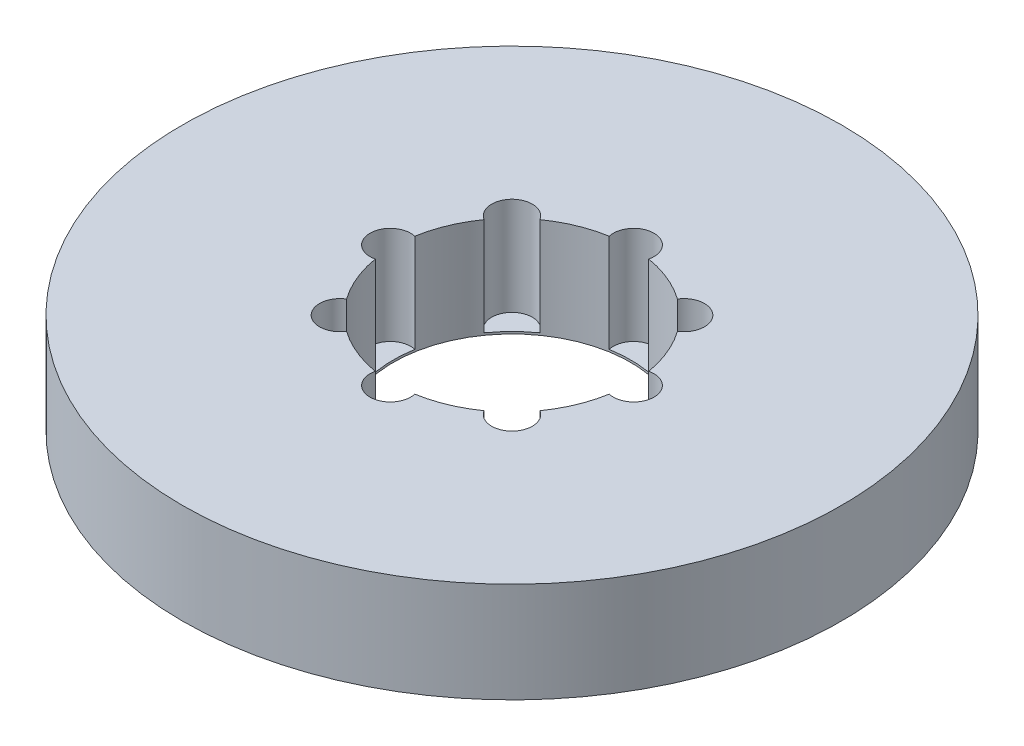
ISO-10303-21;
HEADER;
FILE_DESCRIPTION(('STEP AP214'),'2;1');
FILE_NAME('part.step','',(''),(''),'','','');
FILE_SCHEMA(('AUTOMOTIVE_DESIGN { 1 0 10303 214 1 1 1 1 }'));
ENDSEC;
DATA;
#1=APPLICATION_CONTEXT('core data for automotive mechanical design processes');
#2=APPLICATION_PROTOCOL_DEFINITION('international standard','automotive_design',2000,#1);
#3=PRODUCT_CONTEXT('',#1,'mechanical');
#4=PRODUCT('Part','Part','',(#3));
#5=PRODUCT_RELATED_PRODUCT_CATEGORY('part','',(#4));
#6=PRODUCT_DEFINITION_FORMATION('','',#4);
#7=PRODUCT_DEFINITION_CONTEXT('part definition',#1,'design');
#8=PRODUCT_DEFINITION('design','',#6,#7);
#9=PRODUCT_DEFINITION_SHAPE('','',#8);
#10=(LENGTH_UNIT() NAMED_UNIT(*) SI_UNIT(.MILLI.,.METRE.));
#11=(NAMED_UNIT(*) PLANE_ANGLE_UNIT() SI_UNIT($,.RADIAN.));
#12=(NAMED_UNIT(*) SI_UNIT($,.STERADIAN.) SOLID_ANGLE_UNIT());
#13=UNCERTAINTY_MEASURE_WITH_UNIT(LENGTH_MEASURE(1.E-05),#10,'distance_accuracy_value','');
#14=(GEOMETRIC_REPRESENTATION_CONTEXT(3) GLOBAL_UNCERTAINTY_ASSIGNED_CONTEXT((#13)) GLOBAL_UNIT_ASSIGNED_CONTEXT((#10,
#11,#12)) REPRESENTATION_CONTEXT('',''));
#15=CARTESIAN_POINT('',(0.,0.,0.));
#16=DIRECTION('',(0.,0.,1.));
#17=DIRECTION('',(1.,0.,0.));
#18=AXIS2_PLACEMENT_3D('',#15,#16,#17);
#19=CARTESIAN_POINT('',(0.,19.,0.));
#20=DIRECTION('',(0.,-1.,0.));
#21=DIRECTION('',(0.,0.,-1.));
#22=AXIS2_PLACEMENT_3D('',#19,#20,#21);
#23=CYLINDRICAL_SURFACE('',#22,62.5);
#24=CARTESIAN_POINT('',(0.,19.,0.));
#25=DIRECTION('',(0.,1.,0.));
#26=DIRECTION('',(0.,0.,1.));
#27=AXIS2_PLACEMENT_3D('',#24,#25,#26);
#28=CIRCLE('',#27,62.5);
#29=CARTESIAN_POINT('',(0.,19.,62.5));
#30=VERTEX_POINT('',#29);
#31=EDGE_CURVE('E195',#30,#30,#28,.T.);
#32=ORIENTED_EDGE('',*,*,#31,.F.);
#33=EDGE_LOOP('',(#32));
#34=FACE_BOUND('',#33,.T.);
#35=CARTESIAN_POINT('',(0.,0.,0.));
#36=DIRECTION('',(0.,1.,0.));
#37=DIRECTION('',(0.,0.,1.));
#38=AXIS2_PLACEMENT_3D('',#35,#36,#37);
#39=CIRCLE('',#38,62.5);
#40=CARTESIAN_POINT('',(0.,0.,62.5));
#41=VERTEX_POINT('',#40);
#42=EDGE_CURVE('E179',#41,#41,#39,.T.);
#43=ORIENTED_EDGE('',*,*,#42,.T.);
#44=EDGE_LOOP('',(#43));
#45=FACE_BOUND('',#44,.T.);
#46=ADVANCED_FACE('F39',(#34,#45),#23,.T.);
#47=CARTESIAN_POINT('',(0.,19.,0.));
#48=DIRECTION('',(0.,1.,0.));
#49=DIRECTION('',(0.,0.,1.));
#50=AXIS2_PLACEMENT_3D('',#47,#48,#49);
#51=PLANE('',#50);
#52=CARTESIAN_POINT('',(0.,19.,23.081275633169));
#53=DIRECTION('',(0.,1.,0.));
#54=DIRECTION('',(1.,0.,0.));
#55=AXIS2_PLACEMENT_3D('',#52,#53,#54);
#56=CIRCLE('',#55,3.85155094618896);
#57=CARTESIAN_POINT('',(-3.74604687455838,19.,22.1859670245318));
#58=VERTEX_POINT('',#57);
#59=CARTESIAN_POINT('',(3.74604687455853,19.,22.1859670245318));
#60=VERTEX_POINT('',#59);
#61=EDGE_CURVE('E176',#58,#60,#56,.T.);
#62=ORIENTED_EDGE('',*,*,#61,.F.);
#63=CARTESIAN_POINT('',(0.,19.,0.));
#64=DIRECTION('',(0.,1.,0.));
#65=DIRECTION('',(0.,0.,1.));
#66=AXIS2_PLACEMENT_3D('',#63,#64,#65);
#67=CIRCLE('',#66,22.5);
#68=CARTESIAN_POINT('',(-13.0389925825846,19.,18.3367028778705));
#69=VERTEX_POINT('',#68);
#70=EDGE_CURVE('E166',#69,#58,#67,.T.);
#71=ORIENTED_EDGE('',*,*,#70,.F.);
#72=CARTESIAN_POINT('',(-16.3209265186496,19.,16.3209265186496));
#73=DIRECTION('',(0.,1.,0.));
#74=DIRECTION('',(0.707106781186549,0.,0.707106781186546));
#75=AXIS2_PLACEMENT_3D('',#72,#73,#74);
#76=CIRCLE('',#75,3.85155094618896);
#77=CARTESIAN_POINT('',(-18.3367028778705,19.,13.0389925825846));
#78=VERTEX_POINT('',#77);
#79=EDGE_CURVE('E147',#78,#69,#76,.T.);
#80=ORIENTED_EDGE('',*,*,#79,.F.);
#81=CARTESIAN_POINT('',(-22.1859670245318,19.,3.74604687455846));
#82=VERTEX_POINT('',#81);
#83=EDGE_CURVE('E180',#82,#78,#67,.T.);
#84=ORIENTED_EDGE('',*,*,#83,.F.);
#85=CARTESIAN_POINT('',(-23.081275633169,19.,0.));
#86=DIRECTION('',(0.,1.,0.));
#87=DIRECTION('',(0.,0.,1.));
#88=AXIS2_PLACEMENT_3D('',#85,#86,#87);
#89=CIRCLE('',#88,3.85155094618896);
#90=CARTESIAN_POINT('',(-22.1859670245318,19.,-3.74604687455846));
#91=VERTEX_POINT('',#90);
#92=EDGE_CURVE('E186',#91,#82,#89,.T.);
#93=ORIENTED_EDGE('',*,*,#92,.F.);
#94=CARTESIAN_POINT('',(-18.3367028778707,19.,-13.0389925825844));
#95=VERTEX_POINT('',#94);
#96=EDGE_CURVE('E182',#95,#91,#67,.T.);
#97=ORIENTED_EDGE('',*,*,#96,.F.);
#98=CARTESIAN_POINT('',(-16.3209265186498,19.,-16.3209265186494));
#99=DIRECTION('',(0.,1.,0.));
#100=DIRECTION('',(-0.707106781186539,0.,0.707106781186556));
#101=AXIS2_PLACEMENT_3D('',#98,#99,#100);
#102=CIRCLE('',#101,3.85155094618896);
#103=CARTESIAN_POINT('',(-13.0389925825848,19.,-18.3367028778703));
#104=VERTEX_POINT('',#103);
#105=EDGE_CURVE('E446',#104,#95,#102,.T.);
#106=ORIENTED_EDGE('',*,*,#105,.F.);
#107=CARTESIAN_POINT('',(-3.74604687455869,19.,-22.1859670245317));
#108=VERTEX_POINT('',#107);
#109=EDGE_CURVE('E452',#108,#104,#67,.T.);
#110=ORIENTED_EDGE('',*,*,#109,.F.);
#111=CARTESIAN_POINT('',(-2.41763529449713E-13,19.,-23.081275633169));
#112=DIRECTION('',(0.,1.,0.));
#113=DIRECTION('',(-1.,0.,0.));
#114=AXIS2_PLACEMENT_3D('',#111,#112,#113);
#115=CIRCLE('',#114,3.85155094618896);
#116=CARTESIAN_POINT('',(3.74604687455822,19.,-22.1859670245318));
#117=VERTEX_POINT('',#116);
#118=EDGE_CURVE('E477',#117,#108,#115,.T.);
#119=ORIENTED_EDGE('',*,*,#118,.F.);
#120=CARTESIAN_POINT('',(13.0389925825844,19.,-18.3367028778706));
#121=VERTEX_POINT('',#120);
#122=EDGE_CURVE('E460',#121,#117,#67,.T.);
#123=ORIENTED_EDGE('',*,*,#122,.F.);
#124=CARTESIAN_POINT('',(16.3209265186495,19.,-16.3209265186498));
#125=DIRECTION('',(0.,1.,0.));
#126=DIRECTION('',(-0.707106781186554,0.,-0.707106781186541));
#127=AXIS2_PLACEMENT_3D('',#124,#125,#126);
#128=CIRCLE('',#127,3.85155094618896);
#129=CARTESIAN_POINT('',(18.3367028778704,19.,-13.0389925825847));
#130=VERTEX_POINT('',#129);
#131=EDGE_CURVE('E464',#130,#121,#128,.T.);
#132=ORIENTED_EDGE('',*,*,#131,.F.);
#133=CARTESIAN_POINT('',(22.1859670245318,19.,-3.74604687455846));
#134=VERTEX_POINT('',#133);
#135=EDGE_CURVE('E459',#134,#130,#67,.T.);
#136=ORIENTED_EDGE('',*,*,#135,.F.);
#137=CARTESIAN_POINT('',(23.081275633169,19.,0.));
#138=DIRECTION('',(0.,1.,0.));
#139=DIRECTION('',(0.,0.,-1.));
#140=AXIS2_PLACEMENT_3D('',#137,#138,#139);
#141=CIRCLE('',#140,3.85155094618896);
#142=CARTESIAN_POINT('',(22.1859670245318,19.,3.74604687455846));
#143=VERTEX_POINT('',#142);
#144=EDGE_CURVE('E469',#143,#134,#141,.T.);
#145=ORIENTED_EDGE('',*,*,#144,.F.);
#146=CARTESIAN_POINT('',(18.3367028778706,19.,13.0389925825845));
#147=VERTEX_POINT('',#146);
#148=EDGE_CURVE('E181',#147,#143,#67,.T.);
#149=ORIENTED_EDGE('',*,*,#148,.F.);
#150=CARTESIAN_POINT('',(16.3209265186497,19.,16.3209265186495));
#151=DIRECTION('',(0.,1.,0.));
#152=DIRECTION('',(0.707106781186544,0.,-0.707106781186551));
#153=AXIS2_PLACEMENT_3D('',#150,#151,#152);
#154=CIRCLE('',#153,3.85155094618896);
#155=CARTESIAN_POINT('',(13.0389925825847,19.,18.3367028778704));
#156=VERTEX_POINT('',#155);
#157=EDGE_CURVE('E475',#156,#147,#154,.T.);
#158=ORIENTED_EDGE('',*,*,#157,.F.);
#159=EDGE_CURVE('E177',#60,#156,#67,.T.);
#160=ORIENTED_EDGE('',*,*,#159,.F.);
#161=EDGE_LOOP('',(#62,#71,#80,#84,#93,#97,#106,#110,#119,#123,#132,#136,#145,#149,#158,#160));
#162=FACE_BOUND('',#161,.T.);
#163=ORIENTED_EDGE('',*,*,#31,.T.);
#164=EDGE_LOOP('',(#163));
#165=FACE_BOUND('',#164,.T.);
#166=ADVANCED_FACE('F172',(#162,#165),#51,.T.);
#167=CARTESIAN_POINT('',(0.,0.,0.));
#168=DIRECTION('',(0.,1.,0.));
#169=DIRECTION('',(0.,0.,1.));
#170=AXIS2_PLACEMENT_3D('',#167,#168,#169);
#171=PLANE('',#170);
#172=CARTESIAN_POINT('',(0.,0.,0.));
#173=DIRECTION('',(0.,1.,0.));
#174=DIRECTION('',(0.,0.,1.));
#175=AXIS2_PLACEMENT_3D('',#172,#173,#174);
#176=CIRCLE('',#175,22.5);
#177=CARTESIAN_POINT('',(0.,0.,22.5));
#178=VERTEX_POINT('',#177);
#179=EDGE_CURVE('E187',#178,#178,#176,.T.);
#180=ORIENTED_EDGE('',*,*,#179,.T.);
#181=EDGE_LOOP('',(#180));
#182=FACE_BOUND('',#181,.T.);
#183=ORIENTED_EDGE('',*,*,#42,.F.);
#184=EDGE_LOOP('',(#183));
#185=FACE_BOUND('',#184,.T.);
#186=ADVANCED_FACE('F270',(#182,#185),#171,.F.);
#187=CARTESIAN_POINT('',(0.,19.,0.));
#188=DIRECTION('',(0.,-1.,0.));
#189=DIRECTION('',(0.,0.,-1.));
#190=AXIS2_PLACEMENT_3D('',#187,#188,#189);
#191=CYLINDRICAL_SURFACE('',#190,22.5);
#192=DIRECTION('',(0.,1.,0.));
#193=VECTOR('',#192,1.);
#194=CARTESIAN_POINT('',(-3.74604687455838,9.70790344446366,22.1859670245318));
#195=LINE('',#194,#193);
#196=CARTESIAN_POINT('',(-3.74604687455838,0.415806888927322,22.1859670245318));
#197=VERTEX_POINT('',#196);
#198=EDGE_CURVE('E11',#197,#58,#195,.T.);
#199=ORIENTED_EDGE('',*,*,#198,.F.);
#200=CARTESIAN_POINT('',(0.,0.415806888927322,0.));
#201=DIRECTION('',(0.,1.,0.));
#202=DIRECTION('',(0.,0.,1.));
#203=AXIS2_PLACEMENT_3D('',#200,#201,#202);
#204=CIRCLE('',#203,22.5);
#205=CARTESIAN_POINT('',(3.74604687455853,0.415806888927322,22.1859670245318));
#206=VERTEX_POINT('',#205);
#207=EDGE_CURVE('E250',#197,#206,#204,.T.);
#208=ORIENTED_EDGE('',*,*,#207,.T.);
#209=DIRECTION('',(0.,1.,0.));
#210=VECTOR('',#209,1.);
#211=CARTESIAN_POINT('',(3.74604687455853,9.70790344446366,22.1859670245317));
#212=LINE('',#211,#210);
#213=EDGE_CURVE('E46',#60,#206,#212,.F.);
#214=ORIENTED_EDGE('',*,*,#213,.F.);
#215=ORIENTED_EDGE('',*,*,#159,.T.);
#216=DIRECTION('',(0.,1.,0.));
#217=VECTOR('',#216,1.);
#218=CARTESIAN_POINT('',(13.0389925825847,9.70790344446366,18.3367028778704));
#219=LINE('',#218,#217);
#220=CARTESIAN_POINT('',(13.0389925825847,0.415806888927322,18.3367028778704));
#221=VERTEX_POINT('',#220);
#222=EDGE_CURVE('E244',#221,#156,#219,.T.);
#223=ORIENTED_EDGE('',*,*,#222,.F.);
#224=CARTESIAN_POINT('',(0.,0.415806888927322,0.));
#225=DIRECTION('',(0.,1.,0.));
#226=DIRECTION('',(0.,0.,1.));
#227=AXIS2_PLACEMENT_3D('',#224,#225,#226);
#228=CIRCLE('',#227,22.5);
#229=CARTESIAN_POINT('',(18.3367028778706,0.415806888927322,13.0389925825845));
#230=VERTEX_POINT('',#229);
#231=EDGE_CURVE('E238',#221,#230,#228,.T.);
#232=ORIENTED_EDGE('',*,*,#231,.T.);
#233=DIRECTION('',(0.,1.,0.));
#234=VECTOR('',#233,1.);
#235=CARTESIAN_POINT('',(18.3367028778706,9.70790344446366,13.0389925825845));
#236=LINE('',#235,#234);
#237=EDGE_CURVE('E242',#147,#230,#236,.F.);
#238=ORIENTED_EDGE('',*,*,#237,.F.);
#239=ORIENTED_EDGE('',*,*,#148,.T.);
#240=DIRECTION('',(0.,1.,0.));
#241=VECTOR('',#240,1.);
#242=CARTESIAN_POINT('',(22.1859670245318,9.70790344446366,3.74604687455845));
#243=LINE('',#242,#241);
#244=CARTESIAN_POINT('',(22.1859670245318,0.415806888927322,3.74604687455846));
#245=VERTEX_POINT('',#244);
#246=EDGE_CURVE('E236',#245,#143,#243,.T.);
#247=ORIENTED_EDGE('',*,*,#246,.F.);
#248=CARTESIAN_POINT('',(0.,0.415806888927322,0.));
#249=DIRECTION('',(0.,1.,0.));
#250=DIRECTION('',(0.,0.,1.));
#251=AXIS2_PLACEMENT_3D('',#248,#249,#250);
#252=CIRCLE('',#251,22.5);
#253=CARTESIAN_POINT('',(22.1859670245318,0.415806888927322,-3.74604687455846));
#254=VERTEX_POINT('',#253);
#255=EDGE_CURVE('E235',#245,#254,#252,.T.);
#256=ORIENTED_EDGE('',*,*,#255,.T.);
#257=DIRECTION('',(0.,1.,0.));
#258=VECTOR('',#257,1.);
#259=CARTESIAN_POINT('',(22.1859670245318,9.70790344446366,-3.74604687455845));
#260=LINE('',#259,#258);
#261=EDGE_CURVE('E234',#134,#254,#260,.F.);
#262=ORIENTED_EDGE('',*,*,#261,.F.);
#263=ORIENTED_EDGE('',*,*,#135,.T.);
#264=DIRECTION('',(0.,1.,0.));
#265=VECTOR('',#264,1.);
#266=CARTESIAN_POINT('',(18.3367028778704,9.70790344446366,-13.0389925825847));
#267=LINE('',#266,#265);
#268=CARTESIAN_POINT('',(18.3367028778704,0.415806888927322,-13.0389925825847));
#269=VERTEX_POINT('',#268);
#270=EDGE_CURVE('E229',#269,#130,#267,.T.);
#271=ORIENTED_EDGE('',*,*,#270,.F.);
#272=CARTESIAN_POINT('',(0.,0.415806888927322,0.));
#273=DIRECTION('',(0.,1.,0.));
#274=DIRECTION('',(0.,0.,1.));
#275=AXIS2_PLACEMENT_3D('',#272,#273,#274);
#276=CIRCLE('',#275,22.5);
#277=CARTESIAN_POINT('',(13.0389925825844,0.415806888927322,-18.3367028778706));
#278=VERTEX_POINT('',#277);
#279=EDGE_CURVE('E221',#269,#278,#276,.T.);
#280=ORIENTED_EDGE('',*,*,#279,.T.);
#281=DIRECTION('',(0.,1.,0.));
#282=VECTOR('',#281,1.);
#283=CARTESIAN_POINT('',(13.0389925825844,9.70790344446366,-18.3367028778706));
#284=LINE('',#283,#282);
#285=EDGE_CURVE('E230',#121,#278,#284,.F.);
#286=ORIENTED_EDGE('',*,*,#285,.F.);
#287=ORIENTED_EDGE('',*,*,#122,.T.);
#288=DIRECTION('',(0.,1.,0.));
#289=VECTOR('',#288,1.);
#290=CARTESIAN_POINT('',(3.74604687455822,9.70790344446366,-22.1859670245318));
#291=LINE('',#290,#289);
#292=CARTESIAN_POINT('',(3.74604687455822,0.415806888927322,-22.1859670245318));
#293=VERTEX_POINT('',#292);
#294=EDGE_CURVE('E225',#293,#117,#291,.T.);
#295=ORIENTED_EDGE('',*,*,#294,.F.);
#296=CARTESIAN_POINT('',(0.,0.415806888927322,0.));
#297=DIRECTION('',(0.,1.,0.));
#298=DIRECTION('',(0.,0.,1.));
#299=AXIS2_PLACEMENT_3D('',#296,#297,#298);
#300=CIRCLE('',#299,22.5);
#301=CARTESIAN_POINT('',(-3.74604687455869,0.415806888927322,-22.1859670245317));
#302=VERTEX_POINT('',#301);
#303=EDGE_CURVE('E216',#293,#302,#300,.T.);
#304=ORIENTED_EDGE('',*,*,#303,.T.);
#305=DIRECTION('',(0.,1.,0.));
#306=VECTOR('',#305,1.);
#307=CARTESIAN_POINT('',(-3.74604687455869,9.70790344446366,-22.1859670245317));
#308=LINE('',#307,#306);
#309=EDGE_CURVE('E218',#108,#302,#308,.F.);
#310=ORIENTED_EDGE('',*,*,#309,.F.);
#311=ORIENTED_EDGE('',*,*,#109,.T.);
#312=DIRECTION('',(0.,1.,0.));
#313=VECTOR('',#312,1.);
#314=CARTESIAN_POINT('',(-13.0389925825848,9.70790344446366,-18.3367028778703));
#315=LINE('',#314,#313);
#316=CARTESIAN_POINT('',(-13.0389925825848,0.415806888927322,-18.3367028778703));
#317=VERTEX_POINT('',#316);
#318=EDGE_CURVE('E212',#317,#104,#315,.T.);
#319=ORIENTED_EDGE('',*,*,#318,.F.);
#320=CARTESIAN_POINT('',(0.,0.415806888927322,0.));
#321=DIRECTION('',(0.,1.,0.));
#322=DIRECTION('',(0.,0.,1.));
#323=AXIS2_PLACEMENT_3D('',#320,#321,#322);
#324=CIRCLE('',#323,22.5);
#325=CARTESIAN_POINT('',(-18.3367028778707,0.415806888927322,-13.0389925825844));
#326=VERTEX_POINT('',#325);
#327=EDGE_CURVE('E208',#317,#326,#324,.T.);
#328=ORIENTED_EDGE('',*,*,#327,.T.);
#329=DIRECTION('',(0.,1.,0.));
#330=VECTOR('',#329,1.);
#331=CARTESIAN_POINT('',(-18.3367028778707,9.70790344446366,-13.0389925825844));
#332=LINE('',#331,#330);
#333=EDGE_CURVE('E211',#95,#326,#332,.F.);
#334=ORIENTED_EDGE('',*,*,#333,.F.);
#335=ORIENTED_EDGE('',*,*,#96,.T.);
#336=DIRECTION('',(0.,1.,0.));
#337=VECTOR('',#336,1.);
#338=CARTESIAN_POINT('',(-22.1859670245318,9.70790344446366,-3.74604687455845));
#339=LINE('',#338,#337);
#340=CARTESIAN_POINT('',(-22.1859670245318,0.415806888927322,-3.74604687455846));
#341=VERTEX_POINT('',#340);
#342=EDGE_CURVE('E201',#341,#91,#339,.T.);
#343=ORIENTED_EDGE('',*,*,#342,.F.);
#344=CARTESIAN_POINT('',(0.,0.415806888927322,0.));
#345=DIRECTION('',(0.,1.,0.));
#346=DIRECTION('',(0.,0.,1.));
#347=AXIS2_PLACEMENT_3D('',#344,#345,#346);
#348=CIRCLE('',#347,22.5);
#349=CARTESIAN_POINT('',(-22.1859670245318,0.415806888927322,3.74604687455846));
#350=VERTEX_POINT('',#349);
#351=EDGE_CURVE('E194',#341,#350,#348,.T.);
#352=ORIENTED_EDGE('',*,*,#351,.T.);
#353=DIRECTION('',(0.,1.,0.));
#354=VECTOR('',#353,1.);
#355=CARTESIAN_POINT('',(-22.1859670245318,9.70790344446366,3.74604687455845));
#356=LINE('',#355,#354);
#357=EDGE_CURVE('E199',#82,#350,#356,.F.);
#358=ORIENTED_EDGE('',*,*,#357,.F.);
#359=ORIENTED_EDGE('',*,*,#83,.T.);
#360=DIRECTION('',(0.,1.,0.));
#361=VECTOR('',#360,1.);
#362=CARTESIAN_POINT('',(-18.3367028778705,9.70790344446366,13.0389925825846));
#363=LINE('',#362,#361);
#364=CARTESIAN_POINT('',(-18.3367028778705,0.415806888927322,13.0389925825846));
#365=VERTEX_POINT('',#364);
#366=EDGE_CURVE('E160',#365,#78,#363,.T.);
#367=ORIENTED_EDGE('',*,*,#366,.F.);
#368=CARTESIAN_POINT('',(0.,0.415806888927322,0.));
#369=DIRECTION('',(0.,1.,0.));
#370=DIRECTION('',(0.,0.,1.));
#371=AXIS2_PLACEMENT_3D('',#368,#369,#370);
#372=CIRCLE('',#371,22.5);
#373=CARTESIAN_POINT('',(-13.0389925825846,0.415806888927322,18.3367028778705));
#374=VERTEX_POINT('',#373);
#375=EDGE_CURVE('E168',#365,#374,#372,.T.);
#376=ORIENTED_EDGE('',*,*,#375,.T.);
#377=DIRECTION('',(0.,1.,0.));
#378=VECTOR('',#377,1.);
#379=CARTESIAN_POINT('',(-13.0389925825846,9.70790344446366,18.3367028778705));
#380=LINE('',#379,#378);
#381=EDGE_CURVE('E152',#69,#374,#380,.F.);
#382=ORIENTED_EDGE('',*,*,#381,.F.);
#383=ORIENTED_EDGE('',*,*,#70,.T.);
#384=EDGE_LOOP('',(#199,#208,#214,#215,#223,#232,#238,#239,#247,#256,#262,#263,#271,#280,#286,
#287,#295,#304,#310,#311,#319,#328,#334,#335,#343,#352,#358,#359,#367,#376,#382,#383));
#385=FACE_BOUND('',#384,.T.);
#386=ORIENTED_EDGE('',*,*,#179,.F.);
#387=EDGE_LOOP('',(#386));
#388=FACE_BOUND('',#387,.T.);
#389=ADVANCED_FACE('F170',(#385,#388),#191,.F.);
#390=CARTESIAN_POINT('',(-23.081275633169,0.415806888927322,0.));
#391=DIRECTION('',(0.,1.,0.));
#392=DIRECTION('',(0.,0.,1.));
#393=AXIS2_PLACEMENT_3D('',#390,#391,#392);
#394=CYLINDRICAL_SURFACE('',#393,3.85155094618896);
#395=ORIENTED_EDGE('',*,*,#342,.T.);
#396=ORIENTED_EDGE('',*,*,#92,.T.);
#397=ORIENTED_EDGE('',*,*,#357,.T.);
#398=CARTESIAN_POINT('',(-23.081275633169,0.415806888927322,0.));
#399=DIRECTION('',(0.,1.,0.));
#400=DIRECTION('',(0.,0.,1.));
#401=AXIS2_PLACEMENT_3D('',#398,#399,#400);
#402=CIRCLE('',#401,3.85155094618896);
#403=EDGE_CURVE('E191',#341,#350,#402,.T.);
#404=ORIENTED_EDGE('',*,*,#403,.F.);
#405=EDGE_LOOP('',(#395,#396,#397,#404));
#406=FACE_BOUND('',#405,.T.);
#407=ADVANCED_FACE('F279',(#406),#394,.F.);
#408=CARTESIAN_POINT('',(-23.081275633169,0.415806888927322,0.));
#409=DIRECTION('',(0.,1.,0.));
#410=DIRECTION('',(0.,0.,1.));
#411=AXIS2_PLACEMENT_3D('',#408,#409,#410);
#412=PLANE('',#411);
#413=ORIENTED_EDGE('',*,*,#403,.T.);
#414=ORIENTED_EDGE('',*,*,#351,.F.);
#415=EDGE_LOOP('',(#413,#414));
#416=FACE_BOUND('',#415,.T.);
#417=ADVANCED_FACE('F285',(#416),#412,.T.);
#418=CARTESIAN_POINT('',(-16.3209265186496,0.415806888927322,16.3209265186496));
#419=DIRECTION('',(0.,1.,0.));
#420=DIRECTION('',(0.,0.,1.));
#421=AXIS2_PLACEMENT_3D('',#418,#419,#420);
#422=CYLINDRICAL_SURFACE('',#421,3.85155094618896);
#423=ORIENTED_EDGE('',*,*,#366,.T.);
#424=ORIENTED_EDGE('',*,*,#79,.T.);
#425=ORIENTED_EDGE('',*,*,#381,.T.);
#426=CARTESIAN_POINT('',(-16.3209265186496,0.415806888927322,16.3209265186496));
#427=DIRECTION('',(0.,1.,0.));
#428=DIRECTION('',(0.707106781186549,0.,0.707106781186546));
#429=AXIS2_PLACEMENT_3D('',#426,#427,#428);
#430=CIRCLE('',#429,3.85155094618896);
#431=EDGE_CURVE('E165',#365,#374,#430,.T.);
#432=ORIENTED_EDGE('',*,*,#431,.F.);
#433=EDGE_LOOP('',(#423,#424,#425,#432));
#434=FACE_BOUND('',#433,.T.);
#435=ADVANCED_FACE('F155',(#434),#422,.F.);
#436=CARTESIAN_POINT('',(-16.3209265186496,0.415806888927322,16.3209265186496));
#437=DIRECTION('',(0.,1.,0.));
#438=DIRECTION('',(0.707106781186549,0.,0.707106781186546));
#439=AXIS2_PLACEMENT_3D('',#436,#437,#438);
#440=PLANE('',#439);
#441=ORIENTED_EDGE('',*,*,#431,.T.);
#442=ORIENTED_EDGE('',*,*,#375,.F.);
#443=EDGE_LOOP('',(#441,#442));
#444=FACE_BOUND('',#443,.T.);
#445=ADVANCED_FACE('F288',(#444),#440,.T.);
#446=CARTESIAN_POINT('',(-16.3209265186498,0.415806888927322,-16.3209265186494));
#447=DIRECTION('',(0.,1.,0.));
#448=DIRECTION('',(0.,0.,1.));
#449=AXIS2_PLACEMENT_3D('',#446,#447,#448);
#450=CYLINDRICAL_SURFACE('',#449,3.85155094618896);
#451=ORIENTED_EDGE('',*,*,#318,.T.);
#452=ORIENTED_EDGE('',*,*,#105,.T.);
#453=ORIENTED_EDGE('',*,*,#333,.T.);
#454=CARTESIAN_POINT('',(-16.3209265186498,0.415806888927322,-16.3209265186494));
#455=DIRECTION('',(0.,1.,0.));
#456=DIRECTION('',(-0.707106781186539,0.,0.707106781186556));
#457=AXIS2_PLACEMENT_3D('',#454,#455,#456);
#458=CIRCLE('',#457,3.85155094618896);
#459=EDGE_CURVE('E447',#317,#326,#458,.T.);
#460=ORIENTED_EDGE('',*,*,#459,.F.);
#461=EDGE_LOOP('',(#451,#452,#453,#460));
#462=FACE_BOUND('',#461,.T.);
#463=ADVANCED_FACE('F295',(#462),#450,.F.);
#464=CARTESIAN_POINT('',(-16.3209265186498,0.415806888927322,-16.3209265186494));
#465=DIRECTION('',(0.,1.,0.));
#466=DIRECTION('',(-0.707106781186539,0.,0.707106781186556));
#467=AXIS2_PLACEMENT_3D('',#464,#465,#466);
#468=PLANE('',#467);
#469=ORIENTED_EDGE('',*,*,#459,.T.);
#470=ORIENTED_EDGE('',*,*,#327,.F.);
#471=EDGE_LOOP('',(#469,#470));
#472=FACE_BOUND('',#471,.T.);
#473=ADVANCED_FACE('F375',(#472),#468,.T.);
#474=CARTESIAN_POINT('',(-2.41763529449713E-13,0.415806888927322,-23.081275633169));
#475=DIRECTION('',(0.,1.,0.));
#476=DIRECTION('',(0.,0.,1.));
#477=AXIS2_PLACEMENT_3D('',#474,#475,#476);
#478=CYLINDRICAL_SURFACE('',#477,3.85155094618896);
#479=ORIENTED_EDGE('',*,*,#294,.T.);
#480=ORIENTED_EDGE('',*,*,#118,.T.);
#481=ORIENTED_EDGE('',*,*,#309,.T.);
#482=CARTESIAN_POINT('',(-2.41763529449713E-13,0.415806888927322,-23.081275633169));
#483=DIRECTION('',(0.,1.,0.));
#484=DIRECTION('',(-1.,0.,0.));
#485=AXIS2_PLACEMENT_3D('',#482,#483,#484);
#486=CIRCLE('',#485,3.85155094618896);
#487=EDGE_CURVE('E467',#293,#302,#486,.T.);
#488=ORIENTED_EDGE('',*,*,#487,.F.);
#489=EDGE_LOOP('',(#479,#480,#481,#488));
#490=FACE_BOUND('',#489,.T.);
#491=ADVANCED_FACE('F361',(#490),#478,.F.);
#492=CARTESIAN_POINT('',(-2.41763529449713E-13,0.415806888927322,-23.081275633169));
#493=DIRECTION('',(0.,1.,0.));
#494=DIRECTION('',(-1.,0.,0.));
#495=AXIS2_PLACEMENT_3D('',#492,#493,#494);
#496=PLANE('',#495);
#497=ORIENTED_EDGE('',*,*,#487,.T.);
#498=ORIENTED_EDGE('',*,*,#303,.F.);
#499=EDGE_LOOP('',(#497,#498));
#500=FACE_BOUND('',#499,.T.);
#501=ADVANCED_FACE('F297',(#500),#496,.T.);
#502=CARTESIAN_POINT('',(16.3209265186495,0.415806888927322,-16.3209265186498));
#503=DIRECTION('',(0.,1.,0.));
#504=DIRECTION('',(0.,0.,1.));
#505=AXIS2_PLACEMENT_3D('',#502,#503,#504);
#506=CYLINDRICAL_SURFACE('',#505,3.85155094618896);
#507=ORIENTED_EDGE('',*,*,#270,.T.);
#508=ORIENTED_EDGE('',*,*,#131,.T.);
#509=ORIENTED_EDGE('',*,*,#285,.T.);
#510=CARTESIAN_POINT('',(16.3209265186495,0.415806888927322,-16.3209265186498));
#511=DIRECTION('',(0.,1.,0.));
#512=DIRECTION('',(-0.707106781186554,0.,-0.707106781186541));
#513=AXIS2_PLACEMENT_3D('',#510,#511,#512);
#514=CIRCLE('',#513,3.85155094618896);
#515=EDGE_CURVE('E470',#269,#278,#514,.T.);
#516=ORIENTED_EDGE('',*,*,#515,.F.);
#517=EDGE_LOOP('',(#507,#508,#509,#516));
#518=FACE_BOUND('',#517,.T.);
#519=ADVANCED_FACE('F294',(#518),#506,.F.);
#520=CARTESIAN_POINT('',(16.3209265186495,0.415806888927322,-16.3209265186498));
#521=DIRECTION('',(0.,1.,0.));
#522=DIRECTION('',(-0.707106781186554,0.,-0.707106781186541));
#523=AXIS2_PLACEMENT_3D('',#520,#521,#522);
#524=PLANE('',#523);
#525=ORIENTED_EDGE('',*,*,#515,.T.);
#526=ORIENTED_EDGE('',*,*,#279,.F.);
#527=EDGE_LOOP('',(#525,#526));
#528=FACE_BOUND('',#527,.T.);
#529=ADVANCED_FACE('F300',(#528),#524,.T.);
#530=CARTESIAN_POINT('',(23.081275633169,0.415806888927322,0.));
#531=DIRECTION('',(0.,1.,0.));
#532=DIRECTION('',(0.,0.,1.));
#533=AXIS2_PLACEMENT_3D('',#530,#531,#532);
#534=CYLINDRICAL_SURFACE('',#533,3.85155094618896);
#535=ORIENTED_EDGE('',*,*,#246,.T.);
#536=ORIENTED_EDGE('',*,*,#144,.T.);
#537=ORIENTED_EDGE('',*,*,#261,.T.);
#538=CARTESIAN_POINT('',(23.081275633169,0.415806888927322,0.));
#539=DIRECTION('',(0.,1.,0.));
#540=DIRECTION('',(0.,0.,-1.));
#541=AXIS2_PLACEMENT_3D('',#538,#539,#540);
#542=CIRCLE('',#541,3.85155094618896);
#543=EDGE_CURVE('E472',#245,#254,#542,.T.);
#544=ORIENTED_EDGE('',*,*,#543,.F.);
#545=EDGE_LOOP('',(#535,#536,#537,#544));
#546=FACE_BOUND('',#545,.T.);
#547=ADVANCED_FACE('F305',(#546),#534,.F.);
#548=CARTESIAN_POINT('',(23.081275633169,0.415806888927322,0.));
#549=DIRECTION('',(0.,1.,0.));
#550=DIRECTION('',(0.,0.,-1.));
#551=AXIS2_PLACEMENT_3D('',#548,#549,#550);
#552=PLANE('',#551);
#553=ORIENTED_EDGE('',*,*,#543,.T.);
#554=ORIENTED_EDGE('',*,*,#255,.F.);
#555=EDGE_LOOP('',(#553,#554));
#556=FACE_BOUND('',#555,.T.);
#557=ADVANCED_FACE('F308',(#556),#552,.T.);
#558=CARTESIAN_POINT('',(16.3209265186497,0.415806888927322,16.3209265186495));
#559=DIRECTION('',(0.,1.,0.));
#560=DIRECTION('',(0.,0.,1.));
#561=AXIS2_PLACEMENT_3D('',#558,#559,#560);
#562=CYLINDRICAL_SURFACE('',#561,3.85155094618896);
#563=ORIENTED_EDGE('',*,*,#222,.T.);
#564=ORIENTED_EDGE('',*,*,#157,.T.);
#565=ORIENTED_EDGE('',*,*,#237,.T.);
#566=CARTESIAN_POINT('',(16.3209265186497,0.415806888927322,16.3209265186495));
#567=DIRECTION('',(0.,1.,0.));
#568=DIRECTION('',(0.707106781186544,0.,-0.707106781186551));
#569=AXIS2_PLACEMENT_3D('',#566,#567,#568);
#570=CIRCLE('',#569,3.85155094618896);
#571=EDGE_CURVE('E56',#221,#230,#570,.T.);
#572=ORIENTED_EDGE('',*,*,#571,.F.);
#573=EDGE_LOOP('',(#563,#564,#565,#572));
#574=FACE_BOUND('',#573,.T.);
#575=ADVANCED_FACE('F309',(#574),#562,.F.);
#576=CARTESIAN_POINT('',(16.3209265186497,0.415806888927322,16.3209265186495));
#577=DIRECTION('',(0.,1.,0.));
#578=DIRECTION('',(0.707106781186544,0.,-0.707106781186551));
#579=AXIS2_PLACEMENT_3D('',#576,#577,#578);
#580=PLANE('',#579);
#581=ORIENTED_EDGE('',*,*,#571,.T.);
#582=ORIENTED_EDGE('',*,*,#231,.F.);
#583=EDGE_LOOP('',(#581,#582));
#584=FACE_BOUND('',#583,.T.);
#585=ADVANCED_FACE('F256',(#584),#580,.T.);
#586=CARTESIAN_POINT('',(0.,0.415806888927322,23.081275633169));
#587=DIRECTION('',(0.,1.,0.));
#588=DIRECTION('',(0.,0.,1.));
#589=AXIS2_PLACEMENT_3D('',#586,#587,#588);
#590=CYLINDRICAL_SURFACE('',#589,3.85155094618896);
#591=ORIENTED_EDGE('',*,*,#198,.T.);
#592=ORIENTED_EDGE('',*,*,#61,.T.);
#593=ORIENTED_EDGE('',*,*,#213,.T.);
#594=CARTESIAN_POINT('',(0.,0.415806888927322,23.081275633169));
#595=DIRECTION('',(0.,1.,0.));
#596=DIRECTION('',(1.,0.,0.));
#597=AXIS2_PLACEMENT_3D('',#594,#595,#596);
#598=CIRCLE('',#597,3.85155094618896);
#599=EDGE_CURVE('E55',#197,#206,#598,.T.);
#600=ORIENTED_EDGE('',*,*,#599,.F.);
#601=EDGE_LOOP('',(#591,#592,#593,#600));
#602=FACE_BOUND('',#601,.T.);
#603=ADVANCED_FACE('F253',(#602),#590,.F.);
#604=CARTESIAN_POINT('',(0.,0.415806888927322,23.081275633169));
#605=DIRECTION('',(0.,1.,0.));
#606=DIRECTION('',(1.,0.,0.));
#607=AXIS2_PLACEMENT_3D('',#604,#605,#606);
#608=PLANE('',#607);
#609=ORIENTED_EDGE('',*,*,#599,.T.);
#610=ORIENTED_EDGE('',*,*,#207,.F.);
#611=EDGE_LOOP('',(#609,#610));
#612=FACE_BOUND('',#611,.T.);
#613=ADVANCED_FACE('F252',(#612),#608,.T.);
#614=CLOSED_SHELL('',(#46,#166,#186,#389,#407,#417,#435,#445,#463,#473,#491,#501,#519,#529,#547,
#557,#575,#585,#603,#613));
#615=MANIFOLD_SOLID_BREP('B2',#614);
#616=ADVANCED_BREP_SHAPE_REPRESENTATION('',(#18,#615),#14);
#617=SHAPE_DEFINITION_REPRESENTATION(#9,#616);
ENDSEC;
END-ISO-10303-21;
